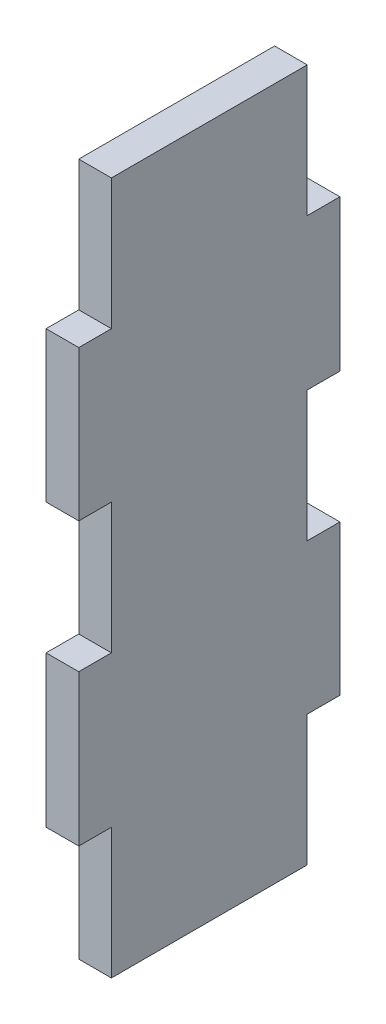
ISO-10303-21;
HEADER;
FILE_DESCRIPTION(('STEP AP214'),'2;1');
FILE_NAME('part.step','',(''),(''),'','','');
FILE_SCHEMA(('AUTOMOTIVE_DESIGN { 1 0 10303 214 1 1 1 1 }'));
ENDSEC;
DATA;
#1=APPLICATION_CONTEXT('core data for automotive mechanical design processes');
#2=APPLICATION_PROTOCOL_DEFINITION('international standard','automotive_design',2000,#1);
#3=PRODUCT_CONTEXT('',#1,'mechanical');
#4=PRODUCT('Part','Part','',(#3));
#5=PRODUCT_RELATED_PRODUCT_CATEGORY('part','',(#4));
#6=PRODUCT_DEFINITION_FORMATION('','',#4);
#7=PRODUCT_DEFINITION_CONTEXT('part definition',#1,'design');
#8=PRODUCT_DEFINITION('design','',#6,#7);
#9=PRODUCT_DEFINITION_SHAPE('','',#8);
#10=(LENGTH_UNIT() NAMED_UNIT(*) SI_UNIT(.MILLI.,.METRE.));
#11=(NAMED_UNIT(*) PLANE_ANGLE_UNIT() SI_UNIT($,.RADIAN.));
#12=(NAMED_UNIT(*) SI_UNIT($,.STERADIAN.) SOLID_ANGLE_UNIT());
#13=UNCERTAINTY_MEASURE_WITH_UNIT(LENGTH_MEASURE(1.E-05),#10,'distance_accuracy_value','');
#14=(GEOMETRIC_REPRESENTATION_CONTEXT(3) GLOBAL_UNCERTAINTY_ASSIGNED_CONTEXT((#13)) GLOBAL_UNIT_ASSIGNED_CONTEXT((#10,
#11,#12)) REPRESENTATION_CONTEXT('',''));
#15=CARTESIAN_POINT('',(0.,0.,0.));
#16=DIRECTION('',(0.,0.,1.));
#17=DIRECTION('',(1.,0.,0.));
#18=AXIS2_PLACEMENT_3D('',#15,#16,#17);
#19=CARTESIAN_POINT('',(427.202863013919,233.079909185498,-25.4000000000001));
#20=DIRECTION('',(0.,0.,-1.));
#21=DIRECTION('',(-1.,0.,0.));
#22=AXIS2_PLACEMENT_3D('',#19,#20,#21);
#23=PLANE('',#22);
#24=DIRECTION('',(1.,0.,0.));
#25=VECTOR('',#24,1.);
#26=CARTESIAN_POINT('',(451.107495352062,159.786269259775,-25.4000000000001));
#27=LINE('',#26,#25);
#28=CARTESIAN_POINT('',(451.107495352062,159.786269259775,-25.4000000000001));
#29=VERTEX_POINT('',#28);
#30=CARTESIAN_POINT('',(454.282495352062,159.786269259775,-25.4000000000001));
#31=VERTEX_POINT('',#30);
#32=EDGE_CURVE('E200',#29,#31,#27,.T.);
#33=ORIENTED_EDGE('',*,*,#32,.F.);
#34=DIRECTION('',(0.,-1.,0.));
#35=VECTOR('',#34,1.);
#36=CARTESIAN_POINT('',(451.107495352062,187.175513848246,-25.4000000000001));
#37=LINE('',#36,#35);
#38=CARTESIAN_POINT('',(451.107495352062,174.475513848246,-25.4000000000001));
#39=VERTEX_POINT('',#38);
#40=EDGE_CURVE('E314',#39,#29,#37,.T.);
#41=ORIENTED_EDGE('',*,*,#40,.F.);
#42=DIRECTION('',(1.,0.,0.));
#43=VECTOR('',#42,1.);
#44=CARTESIAN_POINT('',(451.107495352062,174.475513848246,-25.4000000000001));
#45=LINE('',#44,#43);
#46=CARTESIAN_POINT('',(454.282495352062,174.475513848246,-25.4000000000001));
#47=VERTEX_POINT('',#46);
#48=EDGE_CURVE('E278',#39,#47,#45,.T.);
#49=ORIENTED_EDGE('',*,*,#48,.T.);
#50=DIRECTION('',(0.,1.,0.));
#51=VECTOR('',#50,1.);
#52=CARTESIAN_POINT('',(454.282495352062,119.781269259775,-25.4000000000001));
#53=LINE('',#52,#51);
#54=EDGE_CURVE('E305',#31,#47,#53,.T.);
#55=ORIENTED_EDGE('',*,*,#54,.F.);
#56=EDGE_LOOP('',(#33,#41,#49,#55));
#57=FACE_BOUND('',#56,.T.);
#58=ADVANCED_FACE('F33',(#57),#23,.T.);
#59=CARTESIAN_POINT('',(0.,0.,0.));
#60=DIRECTION('',(0.,0.,1.));
#61=DIRECTION('',(1.,0.,0.));
#62=AXIS2_PLACEMENT_3D('',#59,#60,#61);
#63=PLANE('',#62);
#64=DIRECTION('',(1.,0.,0.));
#65=VECTOR('',#64,1.);
#66=CARTESIAN_POINT('',(451.107495352062,159.870513848246,0.));
#67=LINE('',#66,#65);
#68=CARTESIAN_POINT('',(451.107495352062,159.870513848246,0.));
#69=VERTEX_POINT('',#68);
#70=CARTESIAN_POINT('',(454.282495352062,159.870513848246,0.));
#71=VERTEX_POINT('',#70);
#72=EDGE_CURVE('E218',#69,#71,#67,.T.);
#73=ORIENTED_EDGE('',*,*,#72,.T.);
#74=DIRECTION('',(0.,1.,0.));
#75=VECTOR('',#74,1.);
#76=CARTESIAN_POINT('',(454.282495352062,119.781269259775,0.));
#77=LINE('',#76,#75);
#78=CARTESIAN_POINT('',(454.282495352062,174.475513848246,0.));
#79=VERTEX_POINT('',#78);
#80=EDGE_CURVE('E297',#71,#79,#77,.T.);
#81=ORIENTED_EDGE('',*,*,#80,.T.);
#82=DIRECTION('',(1.,0.,0.));
#83=VECTOR('',#82,1.);
#84=CARTESIAN_POINT('',(451.107495352062,174.475513848246,0.));
#85=LINE('',#84,#83);
#86=CARTESIAN_POINT('',(451.107495352062,174.475513848246,0.));
#87=VERTEX_POINT('',#86);
#88=EDGE_CURVE('E289',#87,#79,#85,.T.);
#89=ORIENTED_EDGE('',*,*,#88,.F.);
#90=DIRECTION('',(0.,-1.,0.));
#91=VECTOR('',#90,1.);
#92=CARTESIAN_POINT('',(451.107495352062,187.175513848246,0.));
#93=LINE('',#92,#91);
#94=EDGE_CURVE('E302',#87,#69,#93,.T.);
#95=ORIENTED_EDGE('',*,*,#94,.T.);
#96=EDGE_LOOP('',(#73,#81,#89,#95));
#97=FACE_BOUND('',#96,.T.);
#98=ADVANCED_FACE('F344',(#97),#63,.T.);
#99=DIRECTION('',(1.,0.,0.));
#100=VECTOR('',#99,1.);
#101=CARTESIAN_POINT('',(451.107495352062,147.086269259775,-25.4000000000001));
#102=LINE('',#101,#100);
#103=CARTESIAN_POINT('',(451.107495352062,147.086269259775,-25.4000000000001));
#104=VERTEX_POINT('',#103);
#105=CARTESIAN_POINT('',(454.282495352062,147.086269259775,-25.4000000000001));
#106=VERTEX_POINT('',#105);
#107=EDGE_CURVE('E48',#104,#106,#102,.T.);
#108=ORIENTED_EDGE('',*,*,#107,.T.);
#109=CARTESIAN_POINT('',(454.282495352062,132.481269259775,-25.4000000000001));
#110=VERTEX_POINT('',#109);
#111=EDGE_CURVE('E310',#110,#106,#53,.T.);
#112=ORIENTED_EDGE('',*,*,#111,.F.);
#113=DIRECTION('',(1.,0.,0.));
#114=VECTOR('',#113,1.);
#115=CARTESIAN_POINT('',(451.107495352062,132.481269259775,-25.4000000000001));
#116=LINE('',#115,#114);
#117=CARTESIAN_POINT('',(451.107495352062,132.481269259775,-25.4000000000001));
#118=VERTEX_POINT('',#117);
#119=EDGE_CURVE('E252',#118,#110,#116,.T.);
#120=ORIENTED_EDGE('',*,*,#119,.F.);
#121=EDGE_CURVE('E316',#104,#118,#37,.T.);
#122=ORIENTED_EDGE('',*,*,#121,.F.);
#123=EDGE_LOOP('',(#108,#112,#120,#122));
#124=FACE_BOUND('',#123,.T.);
#125=ADVANCED_FACE('F35',(#124),#23,.T.);
#126=DIRECTION('',(1.,0.,0.));
#127=VECTOR('',#126,1.);
#128=CARTESIAN_POINT('',(451.107495352062,147.170513848246,0.));
#129=LINE('',#128,#127);
#130=CARTESIAN_POINT('',(451.107495352062,147.170513848246,0.));
#131=VERTEX_POINT('',#130);
#132=CARTESIAN_POINT('',(454.282495352062,147.170513848246,0.));
#133=VERTEX_POINT('',#132);
#134=EDGE_CURVE('E211',#131,#133,#129,.T.);
#135=ORIENTED_EDGE('',*,*,#134,.F.);
#136=CARTESIAN_POINT('',(451.107495352062,132.481269259775,0.));
#137=VERTEX_POINT('',#136);
#138=EDGE_CURVE('E306',#131,#137,#93,.T.);
#139=ORIENTED_EDGE('',*,*,#138,.T.);
#140=DIRECTION('',(1.,0.,0.));
#141=VECTOR('',#140,1.);
#142=CARTESIAN_POINT('',(451.107495352062,132.481269259775,0.));
#143=LINE('',#142,#141);
#144=CARTESIAN_POINT('',(454.282495352062,132.481269259775,0.));
#145=VERTEX_POINT('',#144);
#146=EDGE_CURVE('E238',#137,#145,#143,.T.);
#147=ORIENTED_EDGE('',*,*,#146,.T.);
#148=EDGE_CURVE('E307',#145,#133,#77,.T.);
#149=ORIENTED_EDGE('',*,*,#148,.T.);
#150=EDGE_LOOP('',(#135,#139,#147,#149));
#151=FACE_BOUND('',#150,.T.);
#152=ADVANCED_FACE('F354',(#151),#63,.T.);
#153=CARTESIAN_POINT('',(454.282495352062,119.781269259775,-92.8689916083722));
#154=DIRECTION('',(1.,0.,0.));
#155=DIRECTION('',(0.,0.,-1.));
#156=AXIS2_PLACEMENT_3D('',#153,#154,#155);
#157=PLANE('',#156);
#158=DIRECTION('',(0.,0.,1.));
#159=VECTOR('',#158,1.);
#160=CARTESIAN_POINT('',(454.282495352062,159.786269259775,-22.2250000000001));
#161=LINE('',#160,#159);
#162=CARTESIAN_POINT('',(454.282495352062,159.786269259775,-22.2250000000001));
#163=VERTEX_POINT('',#162);
#164=EDGE_CURVE('E188',#31,#163,#161,.T.);
#165=ORIENTED_EDGE('',*,*,#164,.F.);
#166=ORIENTED_EDGE('',*,*,#54,.T.);
#167=DIRECTION('',(0.,0.,-1.));
#168=VECTOR('',#167,1.);
#169=CARTESIAN_POINT('',(454.282495352062,174.475513848246,-22.2250000000001));
#170=LINE('',#169,#168);
#171=CARTESIAN_POINT('',(454.282495352062,174.475513848246,-22.2250000000001));
#172=VERTEX_POINT('',#171);
#173=EDGE_CURVE('E267',#172,#47,#170,.T.);
#174=ORIENTED_EDGE('',*,*,#173,.F.);
#175=DIRECTION('',(0.,-1.,0.));
#176=VECTOR('',#175,1.);
#177=CARTESIAN_POINT('',(454.282495352062,174.475513848246,-22.2250000000001));
#178=LINE('',#177,#176);
#179=CARTESIAN_POINT('',(454.282495352062,187.175513848246,-22.2250000000001));
#180=VERTEX_POINT('',#179);
#181=EDGE_CURVE('E259',#180,#172,#178,.T.);
#182=ORIENTED_EDGE('',*,*,#181,.F.);
#183=DIRECTION('',(0.,0.,1.));
#184=VECTOR('',#183,1.);
#185=CARTESIAN_POINT('',(454.282495352062,187.175513848246,-92.8689916083722));
#186=LINE('',#185,#184);
#187=CARTESIAN_POINT('',(454.282495352062,187.175513848246,-3.17500000000015));
#188=VERTEX_POINT('',#187);
#189=EDGE_CURVE('E313',#180,#188,#186,.T.);
#190=ORIENTED_EDGE('',*,*,#189,.T.);
#191=DIRECTION('',(0.,1.,0.));
#192=VECTOR('',#191,1.);
#193=CARTESIAN_POINT('',(454.282495352062,187.175513848246,-3.17500000000015));
#194=LINE('',#193,#192);
#195=CARTESIAN_POINT('',(454.282495352062,174.475513848246,-3.17500000000015));
#196=VERTEX_POINT('',#195);
#197=EDGE_CURVE('E286',#196,#188,#194,.T.);
#198=ORIENTED_EDGE('',*,*,#197,.F.);
#199=DIRECTION('',(0.,0.,-1.));
#200=VECTOR('',#199,1.);
#201=CARTESIAN_POINT('',(454.282495352062,174.475513848246,0.));
#202=LINE('',#201,#200);
#203=EDGE_CURVE('E277',#79,#196,#202,.T.);
#204=ORIENTED_EDGE('',*,*,#203,.F.);
#205=ORIENTED_EDGE('',*,*,#80,.F.);
#206=DIRECTION('',(0.,0.,1.));
#207=VECTOR('',#206,1.);
#208=CARTESIAN_POINT('',(454.282495352062,159.870513848246,0.));
#209=LINE('',#208,#207);
#210=CARTESIAN_POINT('',(454.282495352062,159.870513848246,-3.17500000000015));
#211=VERTEX_POINT('',#210);
#212=EDGE_CURVE('E206',#211,#71,#209,.T.);
#213=ORIENTED_EDGE('',*,*,#212,.F.);
#214=DIRECTION('',(0.,1.,0.));
#215=VECTOR('',#214,1.);
#216=CARTESIAN_POINT('',(454.282495352062,147.170513848246,-3.17500000000015));
#217=LINE('',#216,#215);
#218=CARTESIAN_POINT('',(454.282495352062,147.170513848246,-3.17500000000015));
#219=VERTEX_POINT('',#218);
#220=EDGE_CURVE('E214',#219,#211,#217,.T.);
#221=ORIENTED_EDGE('',*,*,#220,.F.);
#222=DIRECTION('',(0.,0.,-1.));
#223=VECTOR('',#222,1.);
#224=CARTESIAN_POINT('',(454.282495352062,147.170513848246,0.));
#225=LINE('',#224,#223);
#226=EDGE_CURVE('E199',#133,#219,#225,.T.);
#227=ORIENTED_EDGE('',*,*,#226,.F.);
#228=ORIENTED_EDGE('',*,*,#148,.F.);
#229=DIRECTION('',(0.,0.,1.));
#230=VECTOR('',#229,1.);
#231=CARTESIAN_POINT('',(454.282495352062,132.481269259775,0.));
#232=LINE('',#231,#230);
#233=CARTESIAN_POINT('',(454.282495352062,132.481269259775,-3.17500000000015));
#234=VERTEX_POINT('',#233);
#235=EDGE_CURVE('E231',#234,#145,#232,.T.);
#236=ORIENTED_EDGE('',*,*,#235,.F.);
#237=DIRECTION('',(0.,1.,0.));
#238=VECTOR('',#237,1.);
#239=CARTESIAN_POINT('',(454.282495352062,119.781269259775,-3.17500000000015));
#240=LINE('',#239,#238);
#241=CARTESIAN_POINT('',(454.282495352062,119.781269259775,-3.17500000000015));
#242=VERTEX_POINT('',#241);
#243=EDGE_CURVE('E221',#242,#234,#240,.T.);
#244=ORIENTED_EDGE('',*,*,#243,.F.);
#245=DIRECTION('',(0.,0.,1.));
#246=VECTOR('',#245,1.);
#247=CARTESIAN_POINT('',(454.282495352062,119.781269259775,-92.8689916083722));
#248=LINE('',#247,#246);
#249=CARTESIAN_POINT('',(454.282495352062,119.781269259775,-22.2250000000001));
#250=VERTEX_POINT('',#249);
#251=EDGE_CURVE('E11',#250,#242,#248,.T.);
#252=ORIENTED_EDGE('',*,*,#251,.F.);
#253=DIRECTION('',(0.,-1.,0.));
#254=VECTOR('',#253,1.);
#255=CARTESIAN_POINT('',(454.282495352062,119.781269259775,-22.2250000000001));
#256=LINE('',#255,#254);
#257=CARTESIAN_POINT('',(454.282495352062,132.481269259775,-22.2250000000001));
#258=VERTEX_POINT('',#257);
#259=EDGE_CURVE('E249',#258,#250,#256,.T.);
#260=ORIENTED_EDGE('',*,*,#259,.F.);
#261=DIRECTION('',(0.,0.,1.));
#262=VECTOR('',#261,1.);
#263=CARTESIAN_POINT('',(454.282495352062,132.481269259775,-25.4000000000001));
#264=LINE('',#263,#262);
#265=EDGE_CURVE('E241',#110,#258,#264,.T.);
#266=ORIENTED_EDGE('',*,*,#265,.F.);
#267=ORIENTED_EDGE('',*,*,#111,.T.);
#268=DIRECTION('',(0.,0.,-1.));
#269=VECTOR('',#268,1.);
#270=CARTESIAN_POINT('',(454.282495352062,147.086269259775,-22.2250000000001));
#271=LINE('',#270,#269);
#272=CARTESIAN_POINT('',(454.282495352062,147.086269259775,-22.2250000000001));
#273=VERTEX_POINT('',#272);
#274=EDGE_CURVE('E191',#273,#106,#271,.T.);
#275=ORIENTED_EDGE('',*,*,#274,.F.);
#276=DIRECTION('',(0.,-1.,0.));
#277=VECTOR('',#276,1.);
#278=CARTESIAN_POINT('',(454.282495352062,147.086269259775,-22.2250000000001));
#279=LINE('',#278,#277);
#280=EDGE_CURVE('E177',#163,#273,#279,.T.);
#281=ORIENTED_EDGE('',*,*,#280,.F.);
#282=EDGE_LOOP('',(#165,#166,#174,#182,#190,#198,#204,#205,#213,#221,#227,#228,#236,#244,#252,
#260,#266,#267,#275,#281));
#283=FACE_BOUND('',#282,.T.);
#284=ADVANCED_FACE('F325',(#283),#157,.T.);
#285=CARTESIAN_POINT('',(454.282495352062,187.175513848246,-92.8689916083722));
#286=DIRECTION('',(0.,1.,0.));
#287=DIRECTION('',(0.,0.,1.));
#288=AXIS2_PLACEMENT_3D('',#285,#286,#287);
#289=PLANE('',#288);
#290=DIRECTION('',(1.,0.,0.));
#291=VECTOR('',#290,1.);
#292=CARTESIAN_POINT('',(451.107495352062,187.175513848246,-22.2250000000001));
#293=LINE('',#292,#291);
#294=CARTESIAN_POINT('',(451.107495352062,187.175513848246,-22.2250000000001));
#295=VERTEX_POINT('',#294);
#296=EDGE_CURVE('E275',#295,#180,#293,.T.);
#297=ORIENTED_EDGE('',*,*,#296,.F.);
#298=DIRECTION('',(0.,0.,1.));
#299=VECTOR('',#298,1.);
#300=CARTESIAN_POINT('',(451.107495352062,187.175513848246,-92.8689916083722));
#301=LINE('',#300,#299);
#302=CARTESIAN_POINT('',(451.107495352062,187.175513848246,-3.17500000000015));
#303=VERTEX_POINT('',#302);
#304=EDGE_CURVE('E319',#295,#303,#301,.T.);
#305=ORIENTED_EDGE('',*,*,#304,.T.);
#306=DIRECTION('',(1.,0.,0.));
#307=VECTOR('',#306,1.);
#308=CARTESIAN_POINT('',(451.107495352062,187.175513848246,-3.17500000000015));
#309=LINE('',#308,#307);
#310=EDGE_CURVE('E294',#303,#188,#309,.T.);
#311=ORIENTED_EDGE('',*,*,#310,.T.);
#312=ORIENTED_EDGE('',*,*,#189,.F.);
#313=EDGE_LOOP('',(#297,#305,#311,#312));
#314=FACE_BOUND('',#313,.T.);
#315=ADVANCED_FACE('F334',(#314),#289,.T.);
#316=CARTESIAN_POINT('',(451.107495352062,187.175513848246,-92.8689916083722));
#317=DIRECTION('',(-1.,0.,0.));
#318=DIRECTION('',(0.,-1.,0.));
#319=AXIS2_PLACEMENT_3D('',#316,#317,#318);
#320=PLANE('',#319);
#321=DIRECTION('',(0.,0.,1.));
#322=VECTOR('',#321,1.);
#323=CARTESIAN_POINT('',(451.107495352062,159.786269259775,-22.2250000000001));
#324=LINE('',#323,#322);
#325=CARTESIAN_POINT('',(451.107495352062,159.786269259775,-22.2250000000001));
#326=VERTEX_POINT('',#325);
#327=EDGE_CURVE('E179',#29,#326,#324,.T.);
#328=ORIENTED_EDGE('',*,*,#327,.T.);
#329=DIRECTION('',(0.,-1.,0.));
#330=VECTOR('',#329,1.);
#331=CARTESIAN_POINT('',(451.107495352062,147.086269259775,-22.2250000000001));
#332=LINE('',#331,#330);
#333=CARTESIAN_POINT('',(451.107495352062,147.086269259775,-22.2250000000001));
#334=VERTEX_POINT('',#333);
#335=EDGE_CURVE('E174',#326,#334,#332,.T.);
#336=ORIENTED_EDGE('',*,*,#335,.T.);
#337=DIRECTION('',(0.,0.,-1.));
#338=VECTOR('',#337,1.);
#339=CARTESIAN_POINT('',(451.107495352062,147.086269259775,-22.2250000000001));
#340=LINE('',#339,#338);
#341=EDGE_CURVE('E181',#334,#104,#340,.T.);
#342=ORIENTED_EDGE('',*,*,#341,.T.);
#343=ORIENTED_EDGE('',*,*,#121,.T.);
#344=DIRECTION('',(0.,0.,1.));
#345=VECTOR('',#344,1.);
#346=CARTESIAN_POINT('',(451.107495352062,132.481269259775,-25.4000000000001));
#347=LINE('',#346,#345);
#348=CARTESIAN_POINT('',(451.107495352062,132.481269259775,-22.2250000000001));
#349=VERTEX_POINT('',#348);
#350=EDGE_CURVE('E245',#118,#349,#347,.T.);
#351=ORIENTED_EDGE('',*,*,#350,.T.);
#352=DIRECTION('',(0.,-1.,0.));
#353=VECTOR('',#352,1.);
#354=CARTESIAN_POINT('',(451.107495352062,119.781269259775,-22.2250000000001));
#355=LINE('',#354,#353);
#356=CARTESIAN_POINT('',(451.107495352062,119.781269259775,-22.2250000000001));
#357=VERTEX_POINT('',#356);
#358=EDGE_CURVE('E248',#349,#357,#355,.T.);
#359=ORIENTED_EDGE('',*,*,#358,.T.);
#360=DIRECTION('',(0.,0.,1.));
#361=VECTOR('',#360,1.);
#362=CARTESIAN_POINT('',(451.107495352062,119.781269259775,-92.8689916083722));
#363=LINE('',#362,#361);
#364=CARTESIAN_POINT('',(451.107495352062,119.781269259775,-3.17500000000015));
#365=VERTEX_POINT('',#364);
#366=EDGE_CURVE('E41',#357,#365,#363,.T.);
#367=ORIENTED_EDGE('',*,*,#366,.T.);
#368=DIRECTION('',(0.,1.,0.));
#369=VECTOR('',#368,1.);
#370=CARTESIAN_POINT('',(451.107495352062,119.781269259775,-3.17500000000015));
#371=LINE('',#370,#369);
#372=CARTESIAN_POINT('',(451.107495352062,132.481269259775,-3.17500000000015));
#373=VERTEX_POINT('',#372);
#374=EDGE_CURVE('E227',#365,#373,#371,.T.);
#375=ORIENTED_EDGE('',*,*,#374,.T.);
#376=DIRECTION('',(0.,0.,1.));
#377=VECTOR('',#376,1.);
#378=CARTESIAN_POINT('',(451.107495352062,132.481269259775,0.));
#379=LINE('',#378,#377);
#380=EDGE_CURVE('E230',#373,#137,#379,.T.);
#381=ORIENTED_EDGE('',*,*,#380,.T.);
#382=ORIENTED_EDGE('',*,*,#138,.F.);
#383=DIRECTION('',(0.,0.,-1.));
#384=VECTOR('',#383,1.);
#385=CARTESIAN_POINT('',(451.107495352062,147.170513848246,0.));
#386=LINE('',#385,#384);
#387=CARTESIAN_POINT('',(451.107495352062,147.170513848246,-3.17500000000015));
#388=VERTEX_POINT('',#387);
#389=EDGE_CURVE('E203',#131,#388,#386,.T.);
#390=ORIENTED_EDGE('',*,*,#389,.T.);
#391=DIRECTION('',(0.,1.,0.));
#392=VECTOR('',#391,1.);
#393=CARTESIAN_POINT('',(451.107495352062,147.170513848246,-3.17500000000015));
#394=LINE('',#393,#392);
#395=CARTESIAN_POINT('',(451.107495352062,159.870513848246,-3.17500000000015));
#396=VERTEX_POINT('',#395);
#397=EDGE_CURVE('E56',#388,#396,#394,.T.);
#398=ORIENTED_EDGE('',*,*,#397,.T.);
#399=DIRECTION('',(0.,0.,1.));
#400=VECTOR('',#399,1.);
#401=CARTESIAN_POINT('',(451.107495352062,159.870513848246,0.));
#402=LINE('',#401,#400);
#403=EDGE_CURVE('E208',#396,#69,#402,.T.);
#404=ORIENTED_EDGE('',*,*,#403,.T.);
#405=ORIENTED_EDGE('',*,*,#94,.F.);
#406=DIRECTION('',(0.,0.,-1.));
#407=VECTOR('',#406,1.);
#408=CARTESIAN_POINT('',(451.107495352062,174.475513848246,0.));
#409=LINE('',#408,#407);
#410=CARTESIAN_POINT('',(451.107495352062,174.475513848246,-3.17500000000015));
#411=VERTEX_POINT('',#410);
#412=EDGE_CURVE('E282',#87,#411,#409,.T.);
#413=ORIENTED_EDGE('',*,*,#412,.T.);
#414=DIRECTION('',(0.,1.,0.));
#415=VECTOR('',#414,1.);
#416=CARTESIAN_POINT('',(451.107495352062,187.175513848246,-3.17500000000015));
#417=LINE('',#416,#415);
#418=EDGE_CURVE('E285',#411,#303,#417,.T.);
#419=ORIENTED_EDGE('',*,*,#418,.T.);
#420=ORIENTED_EDGE('',*,*,#304,.F.);
#421=DIRECTION('',(0.,-1.,0.));
#422=VECTOR('',#421,1.);
#423=CARTESIAN_POINT('',(451.107495352062,174.475513848246,-22.2250000000001));
#424=LINE('',#423,#422);
#425=CARTESIAN_POINT('',(451.107495352062,174.475513848246,-22.2250000000001));
#426=VERTEX_POINT('',#425);
#427=EDGE_CURVE('E263',#295,#426,#424,.T.);
#428=ORIENTED_EDGE('',*,*,#427,.T.);
#429=DIRECTION('',(0.,0.,-1.));
#430=VECTOR('',#429,1.);
#431=CARTESIAN_POINT('',(451.107495352062,174.475513848246,-22.2250000000001));
#432=LINE('',#431,#430);
#433=EDGE_CURVE('E266',#426,#39,#432,.T.);
#434=ORIENTED_EDGE('',*,*,#433,.T.);
#435=ORIENTED_EDGE('',*,*,#40,.T.);
#436=EDGE_LOOP('',(#328,#336,#342,#343,#351,#359,#367,#375,#381,#382,#390,#398,#404,#405,#413,
#419,#420,#428,#434,#435));
#437=FACE_BOUND('',#436,.T.);
#438=ADVANCED_FACE('F186',(#437),#320,.T.);
#439=CARTESIAN_POINT('',(451.107495352062,119.781269259775,-92.8689916083722));
#440=DIRECTION('',(0.,-1.,0.));
#441=DIRECTION('',(0.,0.,-1.));
#442=AXIS2_PLACEMENT_3D('',#439,#440,#441);
#443=PLANE('',#442);
#444=DIRECTION('',(1.,0.,0.));
#445=VECTOR('',#444,1.);
#446=CARTESIAN_POINT('',(451.107495352062,119.781269259775,-3.17500000000015));
#447=LINE('',#446,#445);
#448=EDGE_CURVE('E234',#365,#242,#447,.T.);
#449=ORIENTED_EDGE('',*,*,#448,.F.);
#450=ORIENTED_EDGE('',*,*,#366,.F.);
#451=DIRECTION('',(1.,0.,0.));
#452=VECTOR('',#451,1.);
#453=CARTESIAN_POINT('',(451.107495352062,119.781269259775,-22.2250000000001));
#454=LINE('',#453,#452);
#455=EDGE_CURVE('E256',#357,#250,#454,.T.);
#456=ORIENTED_EDGE('',*,*,#455,.T.);
#457=ORIENTED_EDGE('',*,*,#251,.T.);
#458=EDGE_LOOP('',(#449,#450,#456,#457));
#459=FACE_BOUND('',#458,.T.);
#460=ADVANCED_FACE('F394',(#459),#443,.T.);
#461=CARTESIAN_POINT('',(451.107495352062,187.175513848246,-3.17500000000015));
#462=DIRECTION('',(0.,0.,-1.));
#463=DIRECTION('',(-1.,0.,0.));
#464=AXIS2_PLACEMENT_3D('',#461,#462,#463);
#465=PLANE('',#464);
#466=ORIENTED_EDGE('',*,*,#197,.T.);
#467=ORIENTED_EDGE('',*,*,#310,.F.);
#468=ORIENTED_EDGE('',*,*,#418,.F.);
#469=DIRECTION('',(1.,0.,0.));
#470=VECTOR('',#469,1.);
#471=CARTESIAN_POINT('',(451.107495352062,174.475513848246,-3.17500000000015));
#472=LINE('',#471,#470);
#473=EDGE_CURVE('E298',#411,#196,#472,.T.);
#474=ORIENTED_EDGE('',*,*,#473,.T.);
#475=EDGE_LOOP('',(#466,#467,#468,#474));
#476=FACE_BOUND('',#475,.T.);
#477=ADVANCED_FACE('F332',(#476),#465,.F.);
#478=CARTESIAN_POINT('',(451.107495352062,174.475513848246,0.));
#479=DIRECTION('',(0.,-1.,0.));
#480=DIRECTION('',(0.,0.,-1.));
#481=AXIS2_PLACEMENT_3D('',#478,#479,#480);
#482=PLANE('',#481);
#483=ORIENTED_EDGE('',*,*,#203,.T.);
#484=ORIENTED_EDGE('',*,*,#473,.F.);
#485=ORIENTED_EDGE('',*,*,#412,.F.);
#486=ORIENTED_EDGE('',*,*,#88,.T.);
#487=EDGE_LOOP('',(#483,#484,#485,#486));
#488=FACE_BOUND('',#487,.T.);
#489=ADVANCED_FACE('F338',(#488),#482,.F.);
#490=CARTESIAN_POINT('',(451.107495352062,174.475513848246,-22.2250000000001));
#491=DIRECTION('',(0.,0.,1.));
#492=DIRECTION('',(1.,0.,0.));
#493=AXIS2_PLACEMENT_3D('',#490,#491,#492);
#494=PLANE('',#493);
#495=ORIENTED_EDGE('',*,*,#181,.T.);
#496=DIRECTION('',(1.,0.,0.));
#497=VECTOR('',#496,1.);
#498=CARTESIAN_POINT('',(451.107495352062,174.475513848246,-22.2250000000001));
#499=LINE('',#498,#497);
#500=EDGE_CURVE('E270',#426,#172,#499,.T.);
#501=ORIENTED_EDGE('',*,*,#500,.F.);
#502=ORIENTED_EDGE('',*,*,#427,.F.);
#503=ORIENTED_EDGE('',*,*,#296,.T.);
#504=EDGE_LOOP('',(#495,#501,#502,#503));
#505=FACE_BOUND('',#504,.T.);
#506=ADVANCED_FACE('F414',(#505),#494,.F.);
#507=CARTESIAN_POINT('',(451.107495352062,174.475513848246,-22.2250000000001));
#508=DIRECTION('',(0.,-1.,0.));
#509=DIRECTION('',(0.,0.,-1.));
#510=AXIS2_PLACEMENT_3D('',#507,#508,#509);
#511=PLANE('',#510);
#512=ORIENTED_EDGE('',*,*,#173,.T.);
#513=ORIENTED_EDGE('',*,*,#48,.F.);
#514=ORIENTED_EDGE('',*,*,#433,.F.);
#515=ORIENTED_EDGE('',*,*,#500,.T.);
#516=EDGE_LOOP('',(#512,#513,#514,#515));
#517=FACE_BOUND('',#516,.T.);
#518=ADVANCED_FACE('F410',(#517),#511,.F.);
#519=CARTESIAN_POINT('',(451.107495352062,119.781269259775,-22.2250000000001));
#520=DIRECTION('',(0.,0.,1.));
#521=DIRECTION('',(1.,0.,0.));
#522=AXIS2_PLACEMENT_3D('',#519,#520,#521);
#523=PLANE('',#522);
#524=ORIENTED_EDGE('',*,*,#259,.T.);
#525=ORIENTED_EDGE('',*,*,#455,.F.);
#526=ORIENTED_EDGE('',*,*,#358,.F.);
#527=DIRECTION('',(1.,0.,0.));
#528=VECTOR('',#527,1.);
#529=CARTESIAN_POINT('',(451.107495352062,132.481269259775,-22.2250000000001));
#530=LINE('',#529,#528);
#531=EDGE_CURVE('E260',#349,#258,#530,.T.);
#532=ORIENTED_EDGE('',*,*,#531,.T.);
#533=EDGE_LOOP('',(#524,#525,#526,#532));
#534=FACE_BOUND('',#533,.T.);
#535=ADVANCED_FACE('F406',(#534),#523,.F.);
#536=CARTESIAN_POINT('',(451.107495352062,132.481269259775,-25.4000000000001));
#537=DIRECTION('',(0.,1.,0.));
#538=DIRECTION('',(0.,0.,1.));
#539=AXIS2_PLACEMENT_3D('',#536,#537,#538);
#540=PLANE('',#539);
#541=ORIENTED_EDGE('',*,*,#265,.T.);
#542=ORIENTED_EDGE('',*,*,#531,.F.);
#543=ORIENTED_EDGE('',*,*,#350,.F.);
#544=ORIENTED_EDGE('',*,*,#119,.T.);
#545=EDGE_LOOP('',(#541,#542,#543,#544));
#546=FACE_BOUND('',#545,.T.);
#547=ADVANCED_FACE('F387',(#546),#540,.F.);
#548=CARTESIAN_POINT('',(451.107495352062,132.481269259775,0.));
#549=DIRECTION('',(0.,1.,0.));
#550=DIRECTION('',(0.,0.,1.));
#551=AXIS2_PLACEMENT_3D('',#548,#549,#550);
#552=PLANE('',#551);
#553=ORIENTED_EDGE('',*,*,#235,.T.);
#554=ORIENTED_EDGE('',*,*,#146,.F.);
#555=ORIENTED_EDGE('',*,*,#380,.F.);
#556=DIRECTION('',(1.,0.,0.));
#557=VECTOR('',#556,1.);
#558=CARTESIAN_POINT('',(451.107495352062,132.481269259775,-3.17500000000015));
#559=LINE('',#558,#557);
#560=EDGE_CURVE('E242',#373,#234,#559,.T.);
#561=ORIENTED_EDGE('',*,*,#560,.T.);
#562=EDGE_LOOP('',(#553,#554,#555,#561));
#563=FACE_BOUND('',#562,.T.);
#564=ADVANCED_FACE('F398',(#563),#552,.F.);
#565=CARTESIAN_POINT('',(451.107495352062,119.781269259775,-3.17500000000015));
#566=DIRECTION('',(0.,0.,-1.));
#567=DIRECTION('',(-1.,0.,0.));
#568=AXIS2_PLACEMENT_3D('',#565,#566,#567);
#569=PLANE('',#568);
#570=ORIENTED_EDGE('',*,*,#243,.T.);
#571=ORIENTED_EDGE('',*,*,#560,.F.);
#572=ORIENTED_EDGE('',*,*,#374,.F.);
#573=ORIENTED_EDGE('',*,*,#448,.T.);
#574=EDGE_LOOP('',(#570,#571,#572,#573));
#575=FACE_BOUND('',#574,.T.);
#576=ADVANCED_FACE('F367',(#575),#569,.F.);
#577=CARTESIAN_POINT('',(451.107495352062,159.870513848246,0.));
#578=DIRECTION('',(0.,1.,0.));
#579=DIRECTION('',(0.,0.,1.));
#580=AXIS2_PLACEMENT_3D('',#577,#578,#579);
#581=PLANE('',#580);
#582=ORIENTED_EDGE('',*,*,#212,.T.);
#583=ORIENTED_EDGE('',*,*,#72,.F.);
#584=ORIENTED_EDGE('',*,*,#403,.F.);
#585=DIRECTION('',(1.,0.,0.));
#586=VECTOR('',#585,1.);
#587=CARTESIAN_POINT('',(451.107495352062,159.870513848246,-3.17500000000015));
#588=LINE('',#587,#586);
#589=EDGE_CURVE('E222',#396,#211,#588,.T.);
#590=ORIENTED_EDGE('',*,*,#589,.T.);
#591=EDGE_LOOP('',(#582,#583,#584,#590));
#592=FACE_BOUND('',#591,.T.);
#593=ADVANCED_FACE('F347',(#592),#581,.F.);
#594=CARTESIAN_POINT('',(451.107495352062,147.170513848246,-3.17500000000015));
#595=DIRECTION('',(0.,0.,-1.));
#596=DIRECTION('',(-1.,0.,0.));
#597=AXIS2_PLACEMENT_3D('',#594,#595,#596);
#598=PLANE('',#597);
#599=ORIENTED_EDGE('',*,*,#220,.T.);
#600=ORIENTED_EDGE('',*,*,#589,.F.);
#601=ORIENTED_EDGE('',*,*,#397,.F.);
#602=DIRECTION('',(1.,0.,0.));
#603=VECTOR('',#602,1.);
#604=CARTESIAN_POINT('',(451.107495352062,147.170513848246,-3.17500000000015));
#605=LINE('',#604,#603);
#606=EDGE_CURVE('E224',#388,#219,#605,.T.);
#607=ORIENTED_EDGE('',*,*,#606,.T.);
#608=EDGE_LOOP('',(#599,#600,#601,#607));
#609=FACE_BOUND('',#608,.T.);
#610=ADVANCED_FACE('F359',(#609),#598,.F.);
#611=CARTESIAN_POINT('',(451.107495352062,147.170513848246,0.));
#612=DIRECTION('',(0.,-1.,0.));
#613=DIRECTION('',(0.,0.,-1.));
#614=AXIS2_PLACEMENT_3D('',#611,#612,#613);
#615=PLANE('',#614);
#616=ORIENTED_EDGE('',*,*,#226,.T.);
#617=ORIENTED_EDGE('',*,*,#606,.F.);
#618=ORIENTED_EDGE('',*,*,#389,.F.);
#619=ORIENTED_EDGE('',*,*,#134,.T.);
#620=EDGE_LOOP('',(#616,#617,#618,#619));
#621=FACE_BOUND('',#620,.T.);
#622=ADVANCED_FACE('F351',(#621),#615,.F.);
#623=CARTESIAN_POINT('',(451.107495352062,147.086269259775,-22.2250000000001));
#624=DIRECTION('',(0.,0.,1.));
#625=DIRECTION('',(1.,0.,0.));
#626=AXIS2_PLACEMENT_3D('',#623,#624,#625);
#627=PLANE('',#626);
#628=ORIENTED_EDGE('',*,*,#280,.T.);
#629=DIRECTION('',(1.,0.,0.));
#630=VECTOR('',#629,1.);
#631=CARTESIAN_POINT('',(451.107495352062,147.086269259775,-22.2250000000001));
#632=LINE('',#631,#630);
#633=EDGE_CURVE('E171',#334,#273,#632,.T.);
#634=ORIENTED_EDGE('',*,*,#633,.F.);
#635=ORIENTED_EDGE('',*,*,#335,.F.);
#636=DIRECTION('',(1.,0.,0.));
#637=VECTOR('',#636,1.);
#638=CARTESIAN_POINT('',(451.107495352062,159.786269259775,-22.2250000000001));
#639=LINE('',#638,#637);
#640=EDGE_CURVE('E197',#326,#163,#639,.T.);
#641=ORIENTED_EDGE('',*,*,#640,.T.);
#642=EDGE_LOOP('',(#628,#634,#635,#641));
#643=FACE_BOUND('',#642,.T.);
#644=ADVANCED_FACE('F172',(#643),#627,.F.);
#645=CARTESIAN_POINT('',(451.107495352062,159.786269259775,-22.2250000000001));
#646=DIRECTION('',(0.,1.,0.));
#647=DIRECTION('',(0.,0.,1.));
#648=AXIS2_PLACEMENT_3D('',#645,#646,#647);
#649=PLANE('',#648);
#650=ORIENTED_EDGE('',*,*,#164,.T.);
#651=ORIENTED_EDGE('',*,*,#640,.F.);
#652=ORIENTED_EDGE('',*,*,#327,.F.);
#653=ORIENTED_EDGE('',*,*,#32,.T.);
#654=EDGE_LOOP('',(#650,#651,#652,#653));
#655=FACE_BOUND('',#654,.T.);
#656=ADVANCED_FACE('F504',(#655),#649,.F.);
#657=CARTESIAN_POINT('',(451.107495352062,147.086269259775,-22.2250000000001));
#658=DIRECTION('',(0.,-1.,0.));
#659=DIRECTION('',(0.,0.,-1.));
#660=AXIS2_PLACEMENT_3D('',#657,#658,#659);
#661=PLANE('',#660);
#662=ORIENTED_EDGE('',*,*,#274,.T.);
#663=ORIENTED_EDGE('',*,*,#107,.F.);
#664=ORIENTED_EDGE('',*,*,#341,.F.);
#665=ORIENTED_EDGE('',*,*,#633,.T.);
#666=EDGE_LOOP('',(#662,#663,#664,#665));
#667=FACE_BOUND('',#666,.T.);
#668=ADVANCED_FACE('F182',(#667),#661,.F.);
#669=CLOSED_SHELL('',(#58,#98,#125,#152,#284,#315,#438,#460,#477,#489,#506,#518,#535,#547,#564,
#576,#593,#610,#622,#644,#656,#668));
#670=MANIFOLD_SOLID_BREP('B2',#669);
#671=ADVANCED_BREP_SHAPE_REPRESENTATION('',(#18,#670),#14);
#672=SHAPE_DEFINITION_REPRESENTATION(#9,#671);
ENDSEC;
END-ISO-10303-21;
